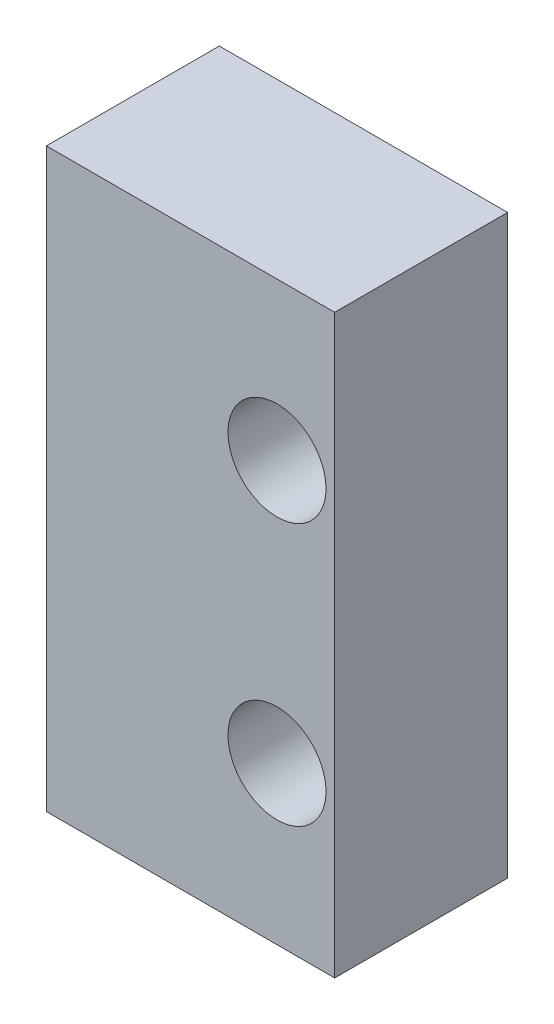
ISO-10303-21;
HEADER;
FILE_DESCRIPTION(('STEP AP214'),'2;1');
FILE_NAME('part.step','',(''),(''),'','','');
FILE_SCHEMA(('AUTOMOTIVE_DESIGN { 1 0 10303 214 1 1 1 1 }'));
ENDSEC;
DATA;
#1=APPLICATION_CONTEXT('core data for automotive mechanical design processes');
#2=APPLICATION_PROTOCOL_DEFINITION('international standard','automotive_design',2000,#1);
#3=PRODUCT_CONTEXT('',#1,'mechanical');
#4=PRODUCT('Part','Part','',(#3));
#5=PRODUCT_RELATED_PRODUCT_CATEGORY('part','',(#4));
#6=PRODUCT_DEFINITION_FORMATION('','',#4);
#7=PRODUCT_DEFINITION_CONTEXT('part definition',#1,'design');
#8=PRODUCT_DEFINITION('design','',#6,#7);
#9=PRODUCT_DEFINITION_SHAPE('','',#8);
#10=(LENGTH_UNIT() NAMED_UNIT(*) SI_UNIT(.MILLI.,.METRE.));
#11=(NAMED_UNIT(*) PLANE_ANGLE_UNIT() SI_UNIT($,.RADIAN.));
#12=(NAMED_UNIT(*) SI_UNIT($,.STERADIAN.) SOLID_ANGLE_UNIT());
#13=UNCERTAINTY_MEASURE_WITH_UNIT(LENGTH_MEASURE(1.E-05),#10,'distance_accuracy_value','');
#14=(GEOMETRIC_REPRESENTATION_CONTEXT(3) GLOBAL_UNCERTAINTY_ASSIGNED_CONTEXT((#13)) GLOBAL_UNIT_ASSIGNED_CONTEXT((#10,
#11,#12)) REPRESENTATION_CONTEXT('',''));
#15=CARTESIAN_POINT('',(0.,0.,0.));
#16=DIRECTION('',(0.,0.,1.));
#17=DIRECTION('',(1.,0.,0.));
#18=AXIS2_PLACEMENT_3D('',#15,#16,#17);
#19=CARTESIAN_POINT('',(0.,0.,3.));
#20=DIRECTION('',(0.,0.,-1.));
#21=DIRECTION('',(-1.,0.,0.));
#22=AXIS2_PLACEMENT_3D('',#19,#20,#21);
#23=PLANE('',#22);
#24=DIRECTION('',(0.,1.,0.));
#25=VECTOR('',#24,1.);
#26=CARTESIAN_POINT('',(5.,-10.,3.));
#27=LINE('',#26,#25);
#28=CARTESIAN_POINT('',(5.,-10.,3.));
#29=VERTEX_POINT('',#28);
#30=CARTESIAN_POINT('',(5.,10.,3.));
#31=VERTEX_POINT('',#30);
#32=EDGE_CURVE('E95',#29,#31,#27,.T.);
#33=ORIENTED_EDGE('',*,*,#32,.T.);
#34=DIRECTION('',(-1.,0.,0.));
#35=VECTOR('',#34,1.);
#36=CARTESIAN_POINT('',(-5.,10.,3.));
#37=LINE('',#36,#35);
#38=CARTESIAN_POINT('',(-5.,10.,3.));
#39=VERTEX_POINT('',#38);
#40=EDGE_CURVE('E90',#31,#39,#37,.T.);
#41=ORIENTED_EDGE('',*,*,#40,.T.);
#42=DIRECTION('',(0.,-1.,0.));
#43=VECTOR('',#42,1.);
#44=CARTESIAN_POINT('',(-5.,-10.,3.));
#45=LINE('',#44,#43);
#46=CARTESIAN_POINT('',(-5.,-10.,3.));
#47=VERTEX_POINT('',#46);
#48=EDGE_CURVE('E93',#39,#47,#45,.T.);
#49=ORIENTED_EDGE('',*,*,#48,.T.);
#50=DIRECTION('',(1.,0.,0.));
#51=VECTOR('',#50,1.);
#52=CARTESIAN_POINT('',(-5.,-10.,3.));
#53=LINE('',#52,#51);
#54=EDGE_CURVE('E60',#47,#29,#53,.T.);
#55=ORIENTED_EDGE('',*,*,#54,.T.);
#56=EDGE_LOOP('',(#33,#41,#49,#55));
#57=FACE_BOUND('',#56,.T.);
#58=CARTESIAN_POINT('',(3.,4.55,3.));
#59=DIRECTION('',(0.,0.,1.));
#60=DIRECTION('',(1.,0.,0.));
#61=AXIS2_PLACEMENT_3D('',#58,#59,#60);
#62=CIRCLE('',#61,1.7);
#63=CARTESIAN_POINT('',(4.7,4.55,3.));
#64=VERTEX_POINT('',#63);
#65=EDGE_CURVE('E110',#64,#64,#62,.T.);
#66=ORIENTED_EDGE('',*,*,#65,.F.);
#67=EDGE_LOOP('',(#66));
#68=FACE_BOUND('',#67,.T.);
#69=CARTESIAN_POINT('',(3.,-4.55,3.));
#70=DIRECTION('',(0.,0.,1.));
#71=DIRECTION('',(-1.,0.,0.));
#72=AXIS2_PLACEMENT_3D('',#69,#70,#71);
#73=CIRCLE('',#72,1.7);
#74=CARTESIAN_POINT('',(1.3,-4.55,3.));
#75=VERTEX_POINT('',#74);
#76=EDGE_CURVE('E125',#75,#75,#73,.T.);
#77=ORIENTED_EDGE('',*,*,#76,.F.);
#78=EDGE_LOOP('',(#77));
#79=FACE_BOUND('',#78,.T.);
#80=ADVANCED_FACE('F43',(#57,#68,#79),#23,.F.);
#81=CARTESIAN_POINT('',(0.,0.,-3.));
#82=DIRECTION('',(0.,0.,-1.));
#83=DIRECTION('',(-1.,0.,0.));
#84=AXIS2_PLACEMENT_3D('',#81,#82,#83);
#85=PLANE('',#84);
#86=CARTESIAN_POINT('',(3.,4.55,-3.));
#87=DIRECTION('',(0.,0.,1.));
#88=DIRECTION('',(1.,0.,0.));
#89=AXIS2_PLACEMENT_3D('',#86,#87,#88);
#90=CIRCLE('',#89,1.7);
#91=CARTESIAN_POINT('',(4.7,4.55,-3.));
#92=VERTEX_POINT('',#91);
#93=EDGE_CURVE('E122',#92,#92,#90,.T.);
#94=ORIENTED_EDGE('',*,*,#93,.T.);
#95=EDGE_LOOP('',(#94));
#96=FACE_BOUND('',#95,.T.);
#97=DIRECTION('',(0.,1.,0.));
#98=VECTOR('',#97,1.);
#99=CARTESIAN_POINT('',(5.,-10.,-3.));
#100=LINE('',#99,#98);
#101=CARTESIAN_POINT('',(5.,-10.,-3.));
#102=VERTEX_POINT('',#101);
#103=CARTESIAN_POINT('',(5.,10.,-3.));
#104=VERTEX_POINT('',#103);
#105=EDGE_CURVE('E107',#102,#104,#100,.T.);
#106=ORIENTED_EDGE('',*,*,#105,.F.);
#107=DIRECTION('',(1.,0.,0.));
#108=VECTOR('',#107,1.);
#109=CARTESIAN_POINT('',(-5.,-10.,-3.));
#110=LINE('',#109,#108);
#111=CARTESIAN_POINT('',(-5.,-10.,-3.));
#112=VERTEX_POINT('',#111);
#113=EDGE_CURVE('E83',#112,#102,#110,.T.);
#114=ORIENTED_EDGE('',*,*,#113,.F.);
#115=DIRECTION('',(0.,-1.,0.));
#116=VECTOR('',#115,1.);
#117=CARTESIAN_POINT('',(-5.,-10.,-3.));
#118=LINE('',#117,#116);
#119=CARTESIAN_POINT('',(-5.,10.,-3.));
#120=VERTEX_POINT('',#119);
#121=EDGE_CURVE('E77',#120,#112,#118,.T.);
#122=ORIENTED_EDGE('',*,*,#121,.F.);
#123=DIRECTION('',(-1.,0.,0.));
#124=VECTOR('',#123,1.);
#125=CARTESIAN_POINT('',(-5.,10.,-3.));
#126=LINE('',#125,#124);
#127=EDGE_CURVE('E99',#104,#120,#126,.T.);
#128=ORIENTED_EDGE('',*,*,#127,.F.);
#129=EDGE_LOOP('',(#106,#114,#122,#128));
#130=FACE_BOUND('',#129,.T.);
#131=CARTESIAN_POINT('',(3.,-4.55,-3.));
#132=DIRECTION('',(0.,0.,1.));
#133=DIRECTION('',(-1.,0.,0.));
#134=AXIS2_PLACEMENT_3D('',#131,#132,#133);
#135=CIRCLE('',#134,1.7);
#136=CARTESIAN_POINT('',(1.3,-4.55,-3.));
#137=VERTEX_POINT('',#136);
#138=EDGE_CURVE('E128',#137,#137,#135,.T.);
#139=ORIENTED_EDGE('',*,*,#138,.T.);
#140=EDGE_LOOP('',(#139));
#141=FACE_BOUND('',#140,.T.);
#142=ADVANCED_FACE('F118',(#96,#130,#141),#85,.T.);
#143=CARTESIAN_POINT('',(5.,-10.,3.));
#144=DIRECTION('',(-1.,0.,0.));
#145=DIRECTION('',(0.,0.,1.));
#146=AXIS2_PLACEMENT_3D('',#143,#144,#145);
#147=PLANE('',#146);
#148=ORIENTED_EDGE('',*,*,#105,.T.);
#149=DIRECTION('',(0.,0.,-1.));
#150=VECTOR('',#149,1.);
#151=CARTESIAN_POINT('',(5.,10.,3.));
#152=LINE('',#151,#150);
#153=EDGE_CURVE('E11',#31,#104,#152,.T.);
#154=ORIENTED_EDGE('',*,*,#153,.F.);
#155=ORIENTED_EDGE('',*,*,#32,.F.);
#156=DIRECTION('',(0.,0.,-1.));
#157=VECTOR('',#156,1.);
#158=CARTESIAN_POINT('',(5.,-10.,3.));
#159=LINE('',#158,#157);
#160=EDGE_CURVE('E103',#29,#102,#159,.T.);
#161=ORIENTED_EDGE('',*,*,#160,.T.);
#162=EDGE_LOOP('',(#148,#154,#155,#161));
#163=FACE_BOUND('',#162,.T.);
#164=ADVANCED_FACE('F45',(#163),#147,.F.);
#165=CARTESIAN_POINT('',(-5.,10.,3.));
#166=DIRECTION('',(0.,-1.,0.));
#167=DIRECTION('',(0.,0.,-1.));
#168=AXIS2_PLACEMENT_3D('',#165,#166,#167);
#169=PLANE('',#168);
#170=ORIENTED_EDGE('',*,*,#127,.T.);
#171=DIRECTION('',(0.,0.,-1.));
#172=VECTOR('',#171,1.);
#173=CARTESIAN_POINT('',(-5.,10.,3.));
#174=LINE('',#173,#172);
#175=EDGE_CURVE('E52',#39,#120,#174,.T.);
#176=ORIENTED_EDGE('',*,*,#175,.F.);
#177=ORIENTED_EDGE('',*,*,#40,.F.);
#178=ORIENTED_EDGE('',*,*,#153,.T.);
#179=EDGE_LOOP('',(#170,#176,#177,#178));
#180=FACE_BOUND('',#179,.T.);
#181=ADVANCED_FACE('F98',(#180),#169,.F.);
#182=CARTESIAN_POINT('',(-5.,-10.,3.));
#183=DIRECTION('',(1.,0.,0.));
#184=DIRECTION('',(0.,0.,-1.));
#185=AXIS2_PLACEMENT_3D('',#182,#183,#184);
#186=PLANE('',#185);
#187=ORIENTED_EDGE('',*,*,#121,.T.);
#188=DIRECTION('',(0.,0.,-1.));
#189=VECTOR('',#188,1.);
#190=CARTESIAN_POINT('',(-5.,-10.,3.));
#191=LINE('',#190,#189);
#192=EDGE_CURVE('E100',#47,#112,#191,.T.);
#193=ORIENTED_EDGE('',*,*,#192,.F.);
#194=ORIENTED_EDGE('',*,*,#48,.F.);
#195=ORIENTED_EDGE('',*,*,#175,.T.);
#196=EDGE_LOOP('',(#187,#193,#194,#195));
#197=FACE_BOUND('',#196,.T.);
#198=ADVANCED_FACE('F101',(#197),#186,.F.);
#199=CARTESIAN_POINT('',(-5.,-10.,3.));
#200=DIRECTION('',(0.,1.,0.));
#201=DIRECTION('',(0.,0.,1.));
#202=AXIS2_PLACEMENT_3D('',#199,#200,#201);
#203=PLANE('',#202);
#204=ORIENTED_EDGE('',*,*,#113,.T.);
#205=ORIENTED_EDGE('',*,*,#160,.F.);
#206=ORIENTED_EDGE('',*,*,#54,.F.);
#207=ORIENTED_EDGE('',*,*,#192,.T.);
#208=EDGE_LOOP('',(#204,#205,#206,#207));
#209=FACE_BOUND('',#208,.T.);
#210=ADVANCED_FACE('F115',(#209),#203,.F.);
#211=CARTESIAN_POINT('',(3.,4.55,3.));
#212=DIRECTION('',(0.,0.,-1.));
#213=DIRECTION('',(-1.,0.,0.));
#214=AXIS2_PLACEMENT_3D('',#211,#212,#213);
#215=CYLINDRICAL_SURFACE('',#214,1.7);
#216=ORIENTED_EDGE('',*,*,#65,.T.);
#217=EDGE_LOOP('',(#216));
#218=FACE_BOUND('',#217,.T.);
#219=ORIENTED_EDGE('',*,*,#93,.F.);
#220=EDGE_LOOP('',(#219));
#221=FACE_BOUND('',#220,.T.);
#222=ADVANCED_FACE('F145',(#218,#221),#215,.F.);
#223=CARTESIAN_POINT('',(3.,-4.55,3.));
#224=DIRECTION('',(0.,0.,-1.));
#225=DIRECTION('',(-1.,0.,0.));
#226=AXIS2_PLACEMENT_3D('',#223,#224,#225);
#227=CYLINDRICAL_SURFACE('',#226,1.7);
#228=ORIENTED_EDGE('',*,*,#76,.T.);
#229=EDGE_LOOP('',(#228));
#230=FACE_BOUND('',#229,.T.);
#231=ORIENTED_EDGE('',*,*,#138,.F.);
#232=EDGE_LOOP('',(#231));
#233=FACE_BOUND('',#232,.T.);
#234=ADVANCED_FACE('F134',(#230,#233),#227,.F.);
#235=CLOSED_SHELL('',(#80,#142,#164,#181,#198,#210,#222,#234));
#236=MANIFOLD_SOLID_BREP('B2',#235);
#237=ADVANCED_BREP_SHAPE_REPRESENTATION('',(#18,#236),#14);
#238=SHAPE_DEFINITION_REPRESENTATION(#9,#237);
ENDSEC;
END-ISO-10303-21;
